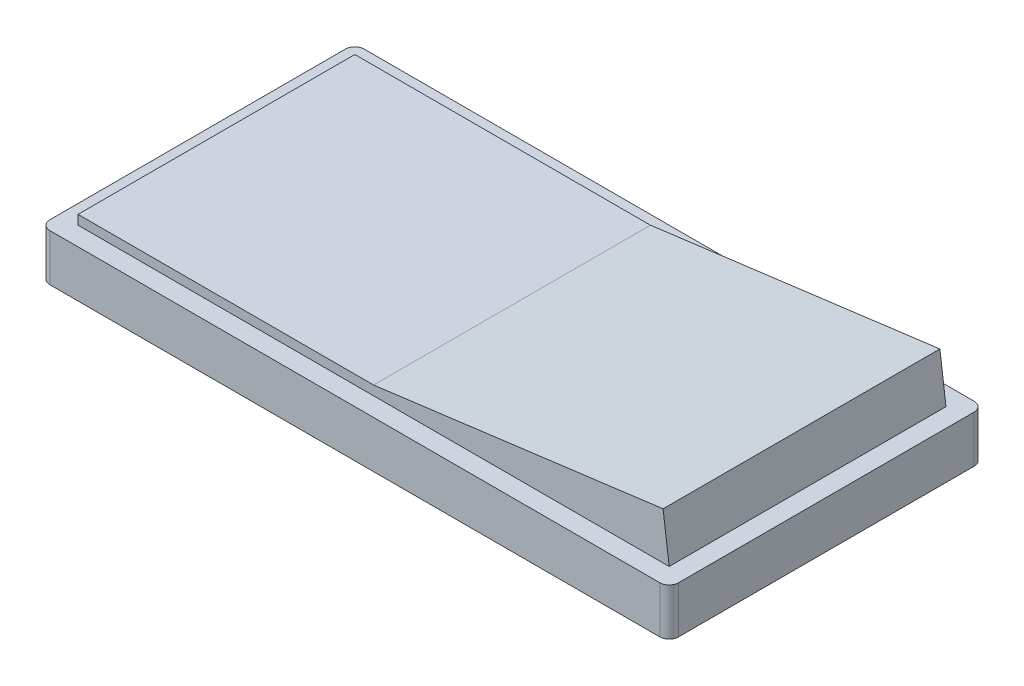
ISO-10303-21;
HEADER;
FILE_DESCRIPTION(('STEP AP214'),'2;1');
FILE_NAME('part.step','',(''),(''),'','','');
FILE_SCHEMA(('AUTOMOTIVE_DESIGN { 1 0 10303 214 1 1 1 1 }'));
ENDSEC;
DATA;
#1=APPLICATION_CONTEXT('core data for automotive mechanical design processes');
#2=APPLICATION_PROTOCOL_DEFINITION('international standard','automotive_design',2000,#1);
#3=PRODUCT_CONTEXT('',#1,'mechanical');
#4=PRODUCT('Part','Part','',(#3));
#5=PRODUCT_RELATED_PRODUCT_CATEGORY('part','',(#4));
#6=PRODUCT_DEFINITION_FORMATION('','',#4);
#7=PRODUCT_DEFINITION_CONTEXT('part definition',#1,'design');
#8=PRODUCT_DEFINITION('design','',#6,#7);
#9=PRODUCT_DEFINITION_SHAPE('','',#8);
#10=(LENGTH_UNIT() NAMED_UNIT(*) SI_UNIT(.MILLI.,.METRE.));
#11=(NAMED_UNIT(*) PLANE_ANGLE_UNIT() SI_UNIT($,.RADIAN.));
#12=(NAMED_UNIT(*) SI_UNIT($,.STERADIAN.) SOLID_ANGLE_UNIT());
#13=UNCERTAINTY_MEASURE_WITH_UNIT(LENGTH_MEASURE(1.E-05),#10,'distance_accuracy_value','');
#14=(GEOMETRIC_REPRESENTATION_CONTEXT(3) GLOBAL_UNCERTAINTY_ASSIGNED_CONTEXT((#13)) GLOBAL_UNIT_ASSIGNED_CONTEXT((#10,
#11,#12)) REPRESENTATION_CONTEXT('',''));
#15=CARTESIAN_POINT('',(0.,0.,0.));
#16=DIRECTION('',(0.,0.,1.));
#17=DIRECTION('',(1.,0.,0.));
#18=AXIS2_PLACEMENT_3D('',#15,#16,#17);
#19=CARTESIAN_POINT('',(31.5,10.,-14.75));
#20=DIRECTION('',(0.,0.,1.));
#21=DIRECTION('',(1.,0.,0.));
#22=AXIS2_PLACEMENT_3D('',#19,#20,#21);
#23=PLANE('',#22);
#24=DIRECTION('',(-1.,0.,0.));
#25=VECTOR('',#24,1.);
#26=CARTESIAN_POINT('',(31.5,6.,-14.75));
#27=LINE('',#26,#25);
#28=CARTESIAN_POINT('',(0.,6.,-14.75));
#29=VERTEX_POINT('',#28);
#30=CARTESIAN_POINT('',(-31.5,6.,-14.75));
#31=VERTEX_POINT('',#30);
#32=EDGE_CURVE('E55',#29,#31,#27,.T.);
#33=ORIENTED_EDGE('',*,*,#32,.F.);
#34=DIRECTION('',(-0.991699635428294,-0.128576176220129,0.));
#35=VECTOR('',#34,1.);
#36=CARTESIAN_POINT('',(31.4892830459503,10.0826591654569,-14.75));
#37=LINE('',#36,#35);
#38=CARTESIAN_POINT('',(30.851738310539,10.,-14.75));
#39=VERTEX_POINT('',#38);
#40=EDGE_CURVE('E150',#39,#29,#37,.T.);
#41=ORIENTED_EDGE('',*,*,#40,.F.);
#42=DIRECTION('',(-0.128576176220126,0.991699635428294,0.));
#43=VECTOR('',#42,1.);
#44=CARTESIAN_POINT('',(30.8624552645887,9.91734083454306,-14.75));
#45=LINE('',#44,#43);
#46=CARTESIAN_POINT('',(31.5,5.,-14.75));
#47=VERTEX_POINT('',#46);
#48=EDGE_CURVE('E149',#47,#39,#45,.T.);
#49=ORIENTED_EDGE('',*,*,#48,.F.);
#50=DIRECTION('',(-1.,0.,0.));
#51=VECTOR('',#50,1.);
#52=CARTESIAN_POINT('',(31.5,5.,-14.75));
#53=LINE('',#52,#51);
#54=CARTESIAN_POINT('',(-31.5,5.,-14.75));
#55=VERTEX_POINT('',#54);
#56=EDGE_CURVE('E136',#47,#55,#53,.T.);
#57=ORIENTED_EDGE('',*,*,#56,.T.);
#58=DIRECTION('',(0.,-1.,0.));
#59=VECTOR('',#58,1.);
#60=CARTESIAN_POINT('',(-31.5,10.,-14.75));
#61=LINE('',#60,#59);
#62=EDGE_CURVE('E166',#31,#55,#61,.T.);
#63=ORIENTED_EDGE('',*,*,#62,.F.);
#64=EDGE_LOOP('',(#33,#41,#49,#57,#63));
#65=FACE_BOUND('',#64,.T.);
#66=ADVANCED_FACE('F39',(#65),#23,.F.);
#67=CARTESIAN_POINT('',(-31.5,10.,-14.75));
#68=DIRECTION('',(1.,0.,0.));
#69=DIRECTION('',(0.,0.,-1.));
#70=AXIS2_PLACEMENT_3D('',#67,#68,#69);
#71=PLANE('',#70);
#72=DIRECTION('',(0.,0.,-1.));
#73=VECTOR('',#72,1.);
#74=CARTESIAN_POINT('',(-31.5,6.,110.466015714647));
#75=LINE('',#74,#73);
#76=CARTESIAN_POINT('',(-31.5,6.,14.75));
#77=VERTEX_POINT('',#76);
#78=EDGE_CURVE('E63',#77,#31,#75,.T.);
#79=ORIENTED_EDGE('',*,*,#78,.T.);
#80=ORIENTED_EDGE('',*,*,#62,.T.);
#81=DIRECTION('',(0.,0.,1.));
#82=VECTOR('',#81,1.);
#83=CARTESIAN_POINT('',(-31.5,5.,-14.75));
#84=LINE('',#83,#82);
#85=CARTESIAN_POINT('',(-31.5,5.,14.75));
#86=VERTEX_POINT('',#85);
#87=EDGE_CURVE('E145',#55,#86,#84,.T.);
#88=ORIENTED_EDGE('',*,*,#87,.T.);
#89=DIRECTION('',(0.,-1.,0.));
#90=VECTOR('',#89,1.);
#91=CARTESIAN_POINT('',(-31.5,10.,14.75));
#92=LINE('',#91,#90);
#93=EDGE_CURVE('E161',#77,#86,#92,.T.);
#94=ORIENTED_EDGE('',*,*,#93,.F.);
#95=EDGE_LOOP('',(#79,#80,#88,#94));
#96=FACE_BOUND('',#95,.T.);
#97=ADVANCED_FACE('F299',(#96),#71,.F.);
#98=CARTESIAN_POINT('',(-31.5,10.,14.75));
#99=DIRECTION('',(0.,0.,-1.));
#100=DIRECTION('',(-1.,0.,0.));
#101=AXIS2_PLACEMENT_3D('',#98,#99,#100);
#102=PLANE('',#101);
#103=DIRECTION('',(1.,0.,0.));
#104=VECTOR('',#103,1.);
#105=CARTESIAN_POINT('',(-31.5,6.,14.75));
#106=LINE('',#105,#104);
#107=CARTESIAN_POINT('',(0.,6.,14.75));
#108=VERTEX_POINT('',#107);
#109=EDGE_CURVE('E11',#77,#108,#106,.T.);
#110=ORIENTED_EDGE('',*,*,#109,.F.);
#111=ORIENTED_EDGE('',*,*,#93,.T.);
#112=DIRECTION('',(1.,0.,0.));
#113=VECTOR('',#112,1.);
#114=CARTESIAN_POINT('',(-31.5,5.,14.75));
#115=LINE('',#114,#113);
#116=CARTESIAN_POINT('',(31.5,5.,14.75));
#117=VERTEX_POINT('',#116);
#118=EDGE_CURVE('E162',#86,#117,#115,.T.);
#119=ORIENTED_EDGE('',*,*,#118,.T.);
#120=DIRECTION('',(0.128576176220126,-0.991699635428294,0.));
#121=VECTOR('',#120,1.);
#122=CARTESIAN_POINT('',(29.8209497798312,17.9504045007256,14.75));
#123=LINE('',#122,#121);
#124=CARTESIAN_POINT('',(30.851738310539,10.,14.75));
#125=VERTEX_POINT('',#124);
#126=EDGE_CURVE('E156',#125,#117,#123,.T.);
#127=ORIENTED_EDGE('',*,*,#126,.F.);
#128=DIRECTION('',(0.991699635428294,0.128576176220129,0.));
#129=VECTOR('',#128,1.);
#130=CARTESIAN_POINT('',(-30.4692114692922,2.04959549927417,14.75));
#131=LINE('',#130,#129);
#132=EDGE_CURVE('E155',#108,#125,#131,.T.);
#133=ORIENTED_EDGE('',*,*,#132,.F.);
#134=EDGE_LOOP('',(#110,#111,#119,#127,#133));
#135=FACE_BOUND('',#134,.T.);
#136=ADVANCED_FACE('F305',(#135),#102,.F.);
#137=CARTESIAN_POINT('',(0.,5.,0.));
#138=DIRECTION('',(0.,-1.,0.));
#139=DIRECTION('',(0.,0.,-1.));
#140=AXIS2_PLACEMENT_3D('',#137,#138,#139);
#141=PLANE('',#140);
#142=ORIENTED_EDGE('',*,*,#56,.F.);
#143=DIRECTION('',(0.,0.,-1.));
#144=VECTOR('',#143,1.);
#145=CARTESIAN_POINT('',(31.5,5.,14.75));
#146=LINE('',#145,#144);
#147=EDGE_CURVE('E142',#117,#47,#146,.T.);
#148=ORIENTED_EDGE('',*,*,#147,.F.);
#149=ORIENTED_EDGE('',*,*,#118,.F.);
#150=ORIENTED_EDGE('',*,*,#87,.F.);
#151=EDGE_LOOP('',(#142,#148,#149,#150));
#152=FACE_BOUND('',#151,.T.);
#153=DIRECTION('',(-1.,0.,0.));
#154=VECTOR('',#153,1.);
#155=CARTESIAN_POINT('',(-33.5,5.,-16.75));
#156=LINE('',#155,#154);
#157=CARTESIAN_POINT('',(32.5,5.,-16.75));
#158=VERTEX_POINT('',#157);
#159=CARTESIAN_POINT('',(-32.5,5.,-16.75));
#160=VERTEX_POINT('',#159);
#161=EDGE_CURVE('E178',#158,#160,#156,.T.);
#162=ORIENTED_EDGE('',*,*,#161,.T.);
#163=CARTESIAN_POINT('',(-32.5,5.,-15.75));
#164=DIRECTION('',(0.,-1.,0.));
#165=DIRECTION('',(0.,0.,-1.));
#166=AXIS2_PLACEMENT_3D('',#163,#164,#165);
#167=CIRCLE('',#166,1.);
#168=CARTESIAN_POINT('',(-33.5,5.,-15.75));
#169=VERTEX_POINT('',#168);
#170=EDGE_CURVE('E230',#160,#169,#167,.F.);
#171=ORIENTED_EDGE('',*,*,#170,.T.);
#172=DIRECTION('',(0.,0.,1.));
#173=VECTOR('',#172,1.);
#174=CARTESIAN_POINT('',(-33.5,5.,16.75));
#175=LINE('',#174,#173);
#176=CARTESIAN_POINT('',(-33.5,5.,15.75));
#177=VERTEX_POINT('',#176);
#178=EDGE_CURVE('E182',#169,#177,#175,.T.);
#179=ORIENTED_EDGE('',*,*,#178,.T.);
#180=CARTESIAN_POINT('',(-32.5,5.,15.75));
#181=DIRECTION('',(0.,-1.,0.));
#182=DIRECTION('',(0.,0.,-1.));
#183=AXIS2_PLACEMENT_3D('',#180,#181,#182);
#184=CIRCLE('',#183,1.);
#185=CARTESIAN_POINT('',(-32.5,5.,16.75));
#186=VERTEX_POINT('',#185);
#187=EDGE_CURVE('E239',#177,#186,#184,.F.);
#188=ORIENTED_EDGE('',*,*,#187,.T.);
#189=DIRECTION('',(1.,0.,0.));
#190=VECTOR('',#189,1.);
#191=CARTESIAN_POINT('',(-33.5,5.,16.75));
#192=LINE('',#191,#190);
#193=CARTESIAN_POINT('',(32.5,5.,16.75));
#194=VERTEX_POINT('',#193);
#195=EDGE_CURVE('E186',#186,#194,#192,.T.);
#196=ORIENTED_EDGE('',*,*,#195,.T.);
#197=CARTESIAN_POINT('',(32.5,5.,15.75));
#198=DIRECTION('',(0.,-1.,0.));
#199=DIRECTION('',(0.,0.,-1.));
#200=AXIS2_PLACEMENT_3D('',#197,#198,#199);
#201=CIRCLE('',#200,1.);
#202=CARTESIAN_POINT('',(33.5,5.,15.75));
#203=VERTEX_POINT('',#202);
#204=EDGE_CURVE('E236',#194,#203,#201,.F.);
#205=ORIENTED_EDGE('',*,*,#204,.T.);
#206=DIRECTION('',(0.,0.,-1.));
#207=VECTOR('',#206,1.);
#208=CARTESIAN_POINT('',(33.5,5.,16.75));
#209=LINE('',#208,#207);
#210=CARTESIAN_POINT('',(33.5,5.,-15.75));
#211=VERTEX_POINT('',#210);
#212=EDGE_CURVE('E174',#203,#211,#209,.T.);
#213=ORIENTED_EDGE('',*,*,#212,.T.);
#214=CARTESIAN_POINT('',(32.5,5.,-15.75));
#215=DIRECTION('',(0.,-1.,0.));
#216=DIRECTION('',(0.,0.,-1.));
#217=AXIS2_PLACEMENT_3D('',#214,#215,#216);
#218=CIRCLE('',#217,1.);
#219=EDGE_CURVE('E233',#211,#158,#218,.F.);
#220=ORIENTED_EDGE('',*,*,#219,.T.);
#221=EDGE_LOOP('',(#162,#171,#179,#188,#196,#205,#213,#220));
#222=FACE_BOUND('',#221,.T.);
#223=ADVANCED_FACE('F138',(#152,#222),#141,.F.);
#224=CARTESIAN_POINT('',(33.5,5.,16.75));
#225=DIRECTION('',(-1.,0.,0.));
#226=DIRECTION('',(0.,0.,1.));
#227=AXIS2_PLACEMENT_3D('',#224,#225,#226);
#228=PLANE('',#227);
#229=ORIENTED_EDGE('',*,*,#212,.F.);
#230=DIRECTION('',(0.,-1.,0.));
#231=VECTOR('',#230,1.);
#232=CARTESIAN_POINT('',(33.5,5.,15.75));
#233=LINE('',#232,#231);
#234=CARTESIAN_POINT('',(33.5,0.,15.75));
#235=VERTEX_POINT('',#234);
#236=EDGE_CURVE('E245',#203,#235,#233,.T.);
#237=ORIENTED_EDGE('',*,*,#236,.T.);
#238=DIRECTION('',(0.,0.,-1.));
#239=VECTOR('',#238,1.);
#240=CARTESIAN_POINT('',(33.5,0.,16.75));
#241=LINE('',#240,#239);
#242=CARTESIAN_POINT('',(33.5,0.,-15.75));
#243=VERTEX_POINT('',#242);
#244=EDGE_CURVE('E173',#235,#243,#241,.T.);
#245=ORIENTED_EDGE('',*,*,#244,.T.);
#246=DIRECTION('',(0.,-1.,0.));
#247=VECTOR('',#246,1.);
#248=CARTESIAN_POINT('',(33.5,5.,-15.75));
#249=LINE('',#248,#247);
#250=EDGE_CURVE('E242',#243,#211,#249,.F.);
#251=ORIENTED_EDGE('',*,*,#250,.T.);
#252=EDGE_LOOP('',(#229,#237,#245,#251));
#253=FACE_BOUND('',#252,.T.);
#254=ADVANCED_FACE('F288',(#253),#228,.F.);
#255=CARTESIAN_POINT('',(-33.5,5.,-16.75));
#256=DIRECTION('',(0.,0.,1.));
#257=DIRECTION('',(1.,0.,0.));
#258=AXIS2_PLACEMENT_3D('',#255,#256,#257);
#259=PLANE('',#258);
#260=ORIENTED_EDGE('',*,*,#161,.F.);
#261=DIRECTION('',(0.,-1.,0.));
#262=VECTOR('',#261,1.);
#263=CARTESIAN_POINT('',(32.5,5.,-16.75));
#264=LINE('',#263,#262);
#265=CARTESIAN_POINT('',(32.5,0.,-16.75));
#266=VERTEX_POINT('',#265);
#267=EDGE_CURVE('E48',#158,#266,#264,.T.);
#268=ORIENTED_EDGE('',*,*,#267,.T.);
#269=DIRECTION('',(-1.,0.,0.));
#270=VECTOR('',#269,1.);
#271=CARTESIAN_POINT('',(-33.5,0.,-16.75));
#272=LINE('',#271,#270);
#273=CARTESIAN_POINT('',(-32.5,0.,-16.75));
#274=VERTEX_POINT('',#273);
#275=EDGE_CURVE('E193',#266,#274,#272,.T.);
#276=ORIENTED_EDGE('',*,*,#275,.T.);
#277=DIRECTION('',(0.,-1.,0.));
#278=VECTOR('',#277,1.);
#279=CARTESIAN_POINT('',(-32.5,5.,-16.75));
#280=LINE('',#279,#278);
#281=EDGE_CURVE('E249',#274,#160,#280,.F.);
#282=ORIENTED_EDGE('',*,*,#281,.T.);
#283=EDGE_LOOP('',(#260,#268,#276,#282));
#284=FACE_BOUND('',#283,.T.);
#285=ADVANCED_FACE('F258',(#284),#259,.F.);
#286=CARTESIAN_POINT('',(-33.5,5.,16.75));
#287=DIRECTION('',(1.,0.,0.));
#288=DIRECTION('',(0.,0.,-1.));
#289=AXIS2_PLACEMENT_3D('',#286,#287,#288);
#290=PLANE('',#289);
#291=DIRECTION('',(0.,0.,1.));
#292=VECTOR('',#291,1.);
#293=CARTESIAN_POINT('',(-33.5,0.,16.75));
#294=LINE('',#293,#292);
#295=CARTESIAN_POINT('',(-33.5,0.,-15.75));
#296=VERTEX_POINT('',#295);
#297=CARTESIAN_POINT('',(-33.5,0.,15.75));
#298=VERTEX_POINT('',#297);
#299=EDGE_CURVE('E197',#296,#298,#294,.T.);
#300=ORIENTED_EDGE('',*,*,#299,.T.);
#301=DIRECTION('',(0.,-1.,0.));
#302=VECTOR('',#301,1.);
#303=CARTESIAN_POINT('',(-33.5,5.,15.75));
#304=LINE('',#303,#302);
#305=EDGE_CURVE('E227',#298,#177,#304,.F.);
#306=ORIENTED_EDGE('',*,*,#305,.T.);
#307=ORIENTED_EDGE('',*,*,#178,.F.);
#308=DIRECTION('',(0.,-1.,0.));
#309=VECTOR('',#308,1.);
#310=CARTESIAN_POINT('',(-33.5,5.,-15.75));
#311=LINE('',#310,#309);
#312=EDGE_CURVE('E223',#169,#296,#311,.T.);
#313=ORIENTED_EDGE('',*,*,#312,.T.);
#314=EDGE_LOOP('',(#300,#306,#307,#313));
#315=FACE_BOUND('',#314,.T.);
#316=ADVANCED_FACE('F272',(#315),#290,.F.);
#317=CARTESIAN_POINT('',(-33.5,5.,16.75));
#318=DIRECTION('',(0.,0.,-1.));
#319=DIRECTION('',(-1.,0.,0.));
#320=AXIS2_PLACEMENT_3D('',#317,#318,#319);
#321=PLANE('',#320);
#322=ORIENTED_EDGE('',*,*,#195,.F.);
#323=DIRECTION('',(0.,-1.,0.));
#324=VECTOR('',#323,1.);
#325=CARTESIAN_POINT('',(-32.5,5.,16.75));
#326=LINE('',#325,#324);
#327=CARTESIAN_POINT('',(-32.5,0.,16.75));
#328=VERTEX_POINT('',#327);
#329=EDGE_CURVE('E207',#186,#328,#326,.T.);
#330=ORIENTED_EDGE('',*,*,#329,.T.);
#331=DIRECTION('',(1.,0.,0.));
#332=VECTOR('',#331,1.);
#333=CARTESIAN_POINT('',(-33.5,0.,16.75));
#334=LINE('',#333,#332);
#335=CARTESIAN_POINT('',(32.5,0.,16.75));
#336=VERTEX_POINT('',#335);
#337=EDGE_CURVE('E179',#328,#336,#334,.T.);
#338=ORIENTED_EDGE('',*,*,#337,.T.);
#339=DIRECTION('',(0.,-1.,0.));
#340=VECTOR('',#339,1.);
#341=CARTESIAN_POINT('',(32.5,5.,16.75));
#342=LINE('',#341,#340);
#343=EDGE_CURVE('E189',#336,#194,#342,.F.);
#344=ORIENTED_EDGE('',*,*,#343,.T.);
#345=EDGE_LOOP('',(#322,#330,#338,#344));
#346=FACE_BOUND('',#345,.T.);
#347=ADVANCED_FACE('F280',(#346),#321,.F.);
#348=CARTESIAN_POINT('',(0.,0.,0.));
#349=DIRECTION('',(0.,-1.,0.));
#350=DIRECTION('',(0.,0.,-1.));
#351=AXIS2_PLACEMENT_3D('',#348,#349,#350);
#352=PLANE('',#351);
#353=ORIENTED_EDGE('',*,*,#337,.F.);
#354=CARTESIAN_POINT('',(-32.5,0.,15.75));
#355=DIRECTION('',(0.,-1.,0.));
#356=DIRECTION('',(0.,0.,-1.));
#357=AXIS2_PLACEMENT_3D('',#354,#355,#356);
#358=CIRCLE('',#357,1.);
#359=EDGE_CURVE('E220',#328,#298,#358,.T.);
#360=ORIENTED_EDGE('',*,*,#359,.T.);
#361=ORIENTED_EDGE('',*,*,#299,.F.);
#362=CARTESIAN_POINT('',(-32.5,0.,-15.75));
#363=DIRECTION('',(0.,-1.,0.));
#364=DIRECTION('',(0.,0.,-1.));
#365=AXIS2_PLACEMENT_3D('',#362,#363,#364);
#366=CIRCLE('',#365,1.);
#367=EDGE_CURVE('E211',#296,#274,#366,.T.);
#368=ORIENTED_EDGE('',*,*,#367,.T.);
#369=ORIENTED_EDGE('',*,*,#275,.F.);
#370=CARTESIAN_POINT('',(32.5,0.,-15.75));
#371=DIRECTION('',(0.,-1.,0.));
#372=DIRECTION('',(0.,0.,-1.));
#373=AXIS2_PLACEMENT_3D('',#370,#371,#372);
#374=CIRCLE('',#373,1.);
#375=EDGE_CURVE('E214',#266,#243,#374,.T.);
#376=ORIENTED_EDGE('',*,*,#375,.T.);
#377=ORIENTED_EDGE('',*,*,#244,.F.);
#378=CARTESIAN_POINT('',(32.5,0.,15.75));
#379=DIRECTION('',(0.,-1.,0.));
#380=DIRECTION('',(0.,0.,-1.));
#381=AXIS2_PLACEMENT_3D('',#378,#379,#380);
#382=CIRCLE('',#381,1.);
#383=EDGE_CURVE('E217',#235,#336,#382,.T.);
#384=ORIENTED_EDGE('',*,*,#383,.T.);
#385=EDGE_LOOP('',(#353,#360,#361,#368,#369,#376,#377,#384));
#386=FACE_BOUND('',#385,.T.);
#387=ADVANCED_FACE('F264',(#386),#352,.T.);
#388=CARTESIAN_POINT('',(-32.5,5.,15.75));
#389=DIRECTION('',(0.,-1.,0.));
#390=DIRECTION('',(0.,0.,-1.));
#391=AXIS2_PLACEMENT_3D('',#388,#389,#390);
#392=CYLINDRICAL_SURFACE('',#391,1.);
#393=ORIENTED_EDGE('',*,*,#187,.F.);
#394=ORIENTED_EDGE('',*,*,#305,.F.);
#395=ORIENTED_EDGE('',*,*,#359,.F.);
#396=ORIENTED_EDGE('',*,*,#329,.F.);
#397=EDGE_LOOP('',(#393,#394,#395,#396));
#398=FACE_BOUND('',#397,.T.);
#399=ADVANCED_FACE('F278',(#398),#392,.T.);
#400=CARTESIAN_POINT('',(32.5,5.,15.75));
#401=DIRECTION('',(0.,-1.,0.));
#402=DIRECTION('',(0.,0.,-1.));
#403=AXIS2_PLACEMENT_3D('',#400,#401,#402);
#404=CYLINDRICAL_SURFACE('',#403,1.);
#405=ORIENTED_EDGE('',*,*,#204,.F.);
#406=ORIENTED_EDGE('',*,*,#343,.F.);
#407=ORIENTED_EDGE('',*,*,#383,.F.);
#408=ORIENTED_EDGE('',*,*,#236,.F.);
#409=EDGE_LOOP('',(#405,#406,#407,#408));
#410=FACE_BOUND('',#409,.T.);
#411=ADVANCED_FACE('F285',(#410),#404,.T.);
#412=CARTESIAN_POINT('',(32.5,5.,-15.75));
#413=DIRECTION('',(0.,-1.,0.));
#414=DIRECTION('',(0.,0.,-1.));
#415=AXIS2_PLACEMENT_3D('',#412,#413,#414);
#416=CYLINDRICAL_SURFACE('',#415,1.);
#417=ORIENTED_EDGE('',*,*,#219,.F.);
#418=ORIENTED_EDGE('',*,*,#250,.F.);
#419=ORIENTED_EDGE('',*,*,#375,.F.);
#420=ORIENTED_EDGE('',*,*,#267,.F.);
#421=EDGE_LOOP('',(#417,#418,#419,#420));
#422=FACE_BOUND('',#421,.T.);
#423=ADVANCED_FACE('F290',(#422),#416,.T.);
#424=CARTESIAN_POINT('',(-32.5,5.,-15.75));
#425=DIRECTION('',(0.,-1.,0.));
#426=DIRECTION('',(0.,0.,-1.));
#427=AXIS2_PLACEMENT_3D('',#424,#425,#426);
#428=CYLINDRICAL_SURFACE('',#427,1.);
#429=ORIENTED_EDGE('',*,*,#170,.F.);
#430=ORIENTED_EDGE('',*,*,#281,.F.);
#431=ORIENTED_EDGE('',*,*,#367,.F.);
#432=ORIENTED_EDGE('',*,*,#312,.F.);
#433=EDGE_LOOP('',(#429,#430,#431,#432));
#434=FACE_BOUND('',#433,.T.);
#435=ADVANCED_FACE('F41',(#434),#428,.T.);
#436=CARTESIAN_POINT('',(-31.5,6.,110.466015714647));
#437=DIRECTION('',(0.,1.,0.));
#438=DIRECTION('',(0.,0.,1.));
#439=AXIS2_PLACEMENT_3D('',#436,#437,#438);
#440=PLANE('',#439);
#441=DIRECTION('',(0.,0.,-1.));
#442=VECTOR('',#441,1.);
#443=CARTESIAN_POINT('',(0.,6.,110.466015714647));
#444=LINE('',#443,#442);
#445=EDGE_CURVE('E409',#108,#29,#444,.T.);
#446=ORIENTED_EDGE('',*,*,#445,.T.);
#447=ORIENTED_EDGE('',*,*,#32,.T.);
#448=ORIENTED_EDGE('',*,*,#78,.F.);
#449=ORIENTED_EDGE('',*,*,#109,.T.);
#450=EDGE_LOOP('',(#446,#447,#448,#449));
#451=FACE_BOUND('',#450,.T.);
#452=ADVANCED_FACE('F296',(#451),#440,.T.);
#453=CARTESIAN_POINT('',(0.,6.,110.466015714647));
#454=DIRECTION('',(-0.128576176220129,0.991699635428294,0.));
#455=DIRECTION('',(-0.991699635428294,-0.128576176220129,0.));
#456=AXIS2_PLACEMENT_3D('',#453,#454,#455);
#457=PLANE('',#456);
#458=DIRECTION('',(0.,0.,-1.));
#459=VECTOR('',#458,1.);
#460=CARTESIAN_POINT('',(30.851738310539,10.,110.466015714647));
#461=LINE('',#460,#459);
#462=EDGE_CURVE('E405',#125,#39,#461,.T.);
#463=ORIENTED_EDGE('',*,*,#462,.T.);
#464=ORIENTED_EDGE('',*,*,#40,.T.);
#465=ORIENTED_EDGE('',*,*,#445,.F.);
#466=ORIENTED_EDGE('',*,*,#132,.T.);
#467=EDGE_LOOP('',(#463,#464,#465,#466));
#468=FACE_BOUND('',#467,.T.);
#469=ADVANCED_FACE('F382',(#468),#457,.T.);
#470=CARTESIAN_POINT('',(30.851738310539,10.,110.466015714647));
#471=DIRECTION('',(0.991699635428294,0.128576176220126,0.));
#472=DIRECTION('',(-0.128576176220126,0.991699635428294,0.));
#473=AXIS2_PLACEMENT_3D('',#470,#471,#472);
#474=PLANE('',#473);
#475=ORIENTED_EDGE('',*,*,#147,.T.);
#476=ORIENTED_EDGE('',*,*,#48,.T.);
#477=ORIENTED_EDGE('',*,*,#462,.F.);
#478=ORIENTED_EDGE('',*,*,#126,.T.);
#479=EDGE_LOOP('',(#475,#476,#477,#478));
#480=FACE_BOUND('',#479,.T.);
#481=ADVANCED_FACE('F159',(#480),#474,.T.);
#482=CLOSED_SHELL('',(#66,#97,#136,#223,#254,#285,#316,#347,#387,#399,#411,#423,#435,#452,#469,#481));
#483=MANIFOLD_SOLID_BREP('B2',#482);
#484=ADVANCED_BREP_SHAPE_REPRESENTATION('',(#18,#483),#14);
#485=SHAPE_DEFINITION_REPRESENTATION(#9,#484);
ENDSEC;
END-ISO-10303-21;
